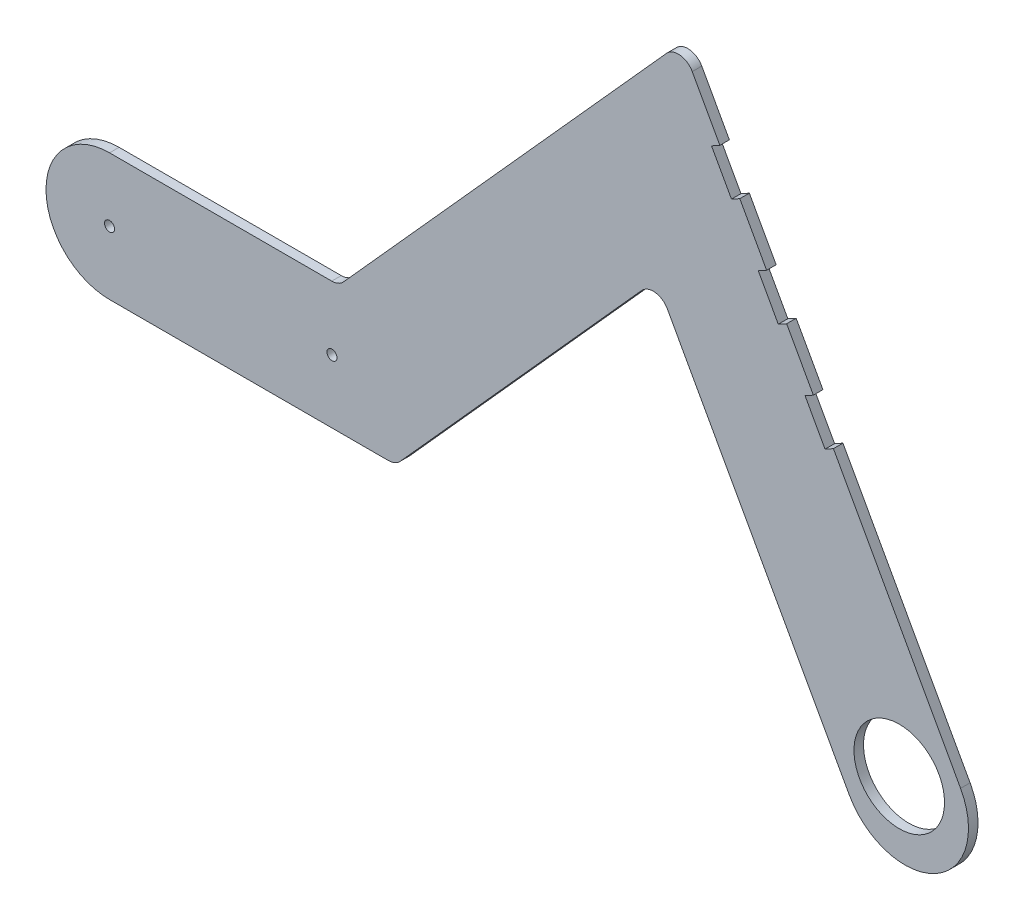
ISO-10303-21;
HEADER;
FILE_DESCRIPTION(('STEP AP214'),'2;1');
FILE_NAME('part.step','',(''),(''),'','','');
FILE_SCHEMA(('AUTOMOTIVE_DESIGN { 1 0 10303 214 1 1 1 1 }'));
ENDSEC;
DATA;
#1=APPLICATION_CONTEXT('core data for automotive mechanical design processes');
#2=APPLICATION_PROTOCOL_DEFINITION('international standard','automotive_design',2000,#1);
#3=PRODUCT_CONTEXT('',#1,'mechanical');
#4=PRODUCT('Part','Part','',(#3));
#5=PRODUCT_RELATED_PRODUCT_CATEGORY('part','',(#4));
#6=PRODUCT_DEFINITION_FORMATION('','',#4);
#7=PRODUCT_DEFINITION_CONTEXT('part definition',#1,'design');
#8=PRODUCT_DEFINITION('design','',#6,#7);
#9=PRODUCT_DEFINITION_SHAPE('','',#8);
#10=(LENGTH_UNIT() NAMED_UNIT(*) SI_UNIT(.MILLI.,.METRE.));
#11=(NAMED_UNIT(*) PLANE_ANGLE_UNIT() SI_UNIT($,.RADIAN.));
#12=(NAMED_UNIT(*) SI_UNIT($,.STERADIAN.) SOLID_ANGLE_UNIT());
#13=UNCERTAINTY_MEASURE_WITH_UNIT(LENGTH_MEASURE(1.E-05),#10,'distance_accuracy_value','');
#14=(GEOMETRIC_REPRESENTATION_CONTEXT(3) GLOBAL_UNCERTAINTY_ASSIGNED_CONTEXT((#13)) GLOBAL_UNIT_ASSIGNED_CONTEXT((#10,
#11,#12)) REPRESENTATION_CONTEXT('',''));
#15=CARTESIAN_POINT('',(0.,0.,0.));
#16=DIRECTION('',(0.,0.,1.));
#17=DIRECTION('',(1.,0.,0.));
#18=AXIS2_PLACEMENT_3D('',#15,#16,#17);
#19=CARTESIAN_POINT('',(47.5853332188057,145.502393907556,3.));
#20=DIRECTION('',(-0.875653678217041,-0.482939577820007,0.));
#21=DIRECTION('',(0.482939577820007,-0.875653678217041,0.));
#22=AXIS2_PLACEMENT_3D('',#19,#20,#21);
#23=PLANE('',#22);
#24=DIRECTION('',(-0.482939577820007,0.875653678217041,0.));
#25=VECTOR('',#24,1.);
#26=CARTESIAN_POINT('',(47.5853332188057,145.502393907556,3.));
#27=LINE('',#26,#25);
#28=CARTESIAN_POINT('',(56.2782456195659,129.740627699649,3.));
#29=VERTEX_POINT('',#28);
#30=CARTESIAN_POINT('',(47.5853332188057,145.502393907556,3.));
#31=VERTEX_POINT('',#30);
#32=EDGE_CURVE('E320',#29,#31,#27,.T.);
#33=ORIENTED_EDGE('',*,*,#32,.F.);
#34=DIRECTION('',(0.,0.,1.));
#35=VECTOR('',#34,1.);
#36=CARTESIAN_POINT('',(56.2782456195659,129.740627699649,3.));
#37=LINE('',#36,#35);
#38=CARTESIAN_POINT('',(56.2782456195659,129.740627699649,0.));
#39=VERTEX_POINT('',#38);
#40=EDGE_CURVE('E221',#39,#29,#37,.T.);
#41=ORIENTED_EDGE('',*,*,#40,.F.);
#42=DIRECTION('',(-0.482939577820007,0.875653678217041,0.));
#43=VECTOR('',#42,1.);
#44=CARTESIAN_POINT('',(47.5853332188057,145.502393907556,0.));
#45=LINE('',#44,#43);
#46=CARTESIAN_POINT('',(47.5853332188057,145.502393907556,0.));
#47=VERTEX_POINT('',#46);
#48=EDGE_CURVE('E348',#39,#47,#45,.T.);
#49=ORIENTED_EDGE('',*,*,#48,.T.);
#50=DIRECTION('',(0.,0.,-1.));
#51=VECTOR('',#50,1.);
#52=CARTESIAN_POINT('',(47.5853332188057,145.502393907556,3.));
#53=LINE('',#52,#51);
#54=EDGE_CURVE('E371',#31,#47,#53,.T.);
#55=ORIENTED_EDGE('',*,*,#54,.F.);
#56=EDGE_LOOP('',(#33,#41,#49,#55));
#57=FACE_BOUND('',#56,.T.);
#58=ADVANCED_FACE('F45',(#57),#23,.F.);
#59=CARTESIAN_POINT('',(70.9962652568578,103.054291306096,0.));
#60=VERTEX_POINT('',#59);
#61=CARTESIAN_POINT('',(62.5576471519857,118.354977607176,0.));
#62=VERTEX_POINT('',#61);
#63=EDGE_CURVE('E443',#60,#62,#45,.T.);
#64=ORIENTED_EDGE('',*,*,#63,.T.);
#65=DIRECTION('',(0.,0.,-1.));
#66=VECTOR('',#65,1.);
#67=CARTESIAN_POINT('',(62.5576471519857,118.354977607176,3.));
#68=LINE('',#67,#66);
#69=CARTESIAN_POINT('',(62.5576471519857,118.354977607176,3.));
#70=VERTEX_POINT('',#69);
#71=EDGE_CURVE('E250',#70,#62,#68,.T.);
#72=ORIENTED_EDGE('',*,*,#71,.F.);
#73=CARTESIAN_POINT('',(70.9962652568578,103.054291306096,3.));
#74=VERTEX_POINT('',#73);
#75=EDGE_CURVE('E228',#74,#70,#27,.T.);
#76=ORIENTED_EDGE('',*,*,#75,.F.);
#77=DIRECTION('',(0.,0.,1.));
#78=VECTOR('',#77,1.);
#79=CARTESIAN_POINT('',(70.9962652568578,103.054291306096,3.));
#80=LINE('',#79,#78);
#81=EDGE_CURVE('E245',#60,#74,#80,.T.);
#82=ORIENTED_EDGE('',*,*,#81,.F.);
#83=EDGE_LOOP('',(#64,#72,#76,#82));
#84=FACE_BOUND('',#83,.T.);
#85=ADVANCED_FACE('F481',(#84),#23,.F.);
#86=CARTESIAN_POINT('',(85.7142848941497,76.3679549125424,0.));
#87=VERTEX_POINT('',#86);
#88=CARTESIAN_POINT('',(77.2977547409545,91.628591905141,0.));
#89=VERTEX_POINT('',#88);
#90=EDGE_CURVE('E353',#87,#89,#45,.T.);
#91=ORIENTED_EDGE('',*,*,#90,.T.);
#92=DIRECTION('',(0.,0.,-1.));
#93=VECTOR('',#92,1.);
#94=CARTESIAN_POINT('',(77.2977547409545,91.628591905141,3.));
#95=LINE('',#94,#93);
#96=CARTESIAN_POINT('',(77.2977547409545,91.628591905141,3.));
#97=VERTEX_POINT('',#96);
#98=EDGE_CURVE('E247',#97,#89,#95,.T.);
#99=ORIENTED_EDGE('',*,*,#98,.F.);
#100=CARTESIAN_POINT('',(85.7142848941497,76.3679549125424,3.));
#101=VERTEX_POINT('',#100);
#102=EDGE_CURVE('E325',#101,#97,#27,.T.);
#103=ORIENTED_EDGE('',*,*,#102,.F.);
#104=DIRECTION('',(0.,0.,1.));
#105=VECTOR('',#104,1.);
#106=CARTESIAN_POINT('',(85.7142848941497,76.3679549125424,3.));
#107=LINE('',#106,#105);
#108=EDGE_CURVE('E271',#87,#101,#107,.T.);
#109=ORIENTED_EDGE('',*,*,#108,.F.);
#110=EDGE_LOOP('',(#91,#99,#103,#109));
#111=FACE_BOUND('',#110,.T.);
#112=ADVANCED_FACE('F452',(#111),#23,.F.);
#113=CARTESIAN_POINT('',(-135.81117841602,11.660861845859,3.));
#114=DIRECTION('',(0.,0.,-1.));
#115=DIRECTION('',(-1.,0.,0.));
#116=AXIS2_PLACEMENT_3D('',#113,#114,#115);
#117=PLANE('',#116);
#118=DIRECTION('',(0.482939577820008,-0.875653678217041,0.));
#119=VECTOR('',#118,1.);
#120=CARTESIAN_POINT('',(53.6512845849147,128.291808966189,3.));
#121=LINE('',#120,#119);
#122=CARTESIAN_POINT('',(53.6512845849147,128.291808966189,3.));
#123=VERTEX_POINT('',#122);
#124=CARTESIAN_POINT('',(59.9306861173346,116.906158873716,3.));
#125=VERTEX_POINT('',#124);
#126=EDGE_CURVE('E212',#123,#125,#121,.T.);
#127=ORIENTED_EDGE('',*,*,#126,.F.);
#128=DIRECTION('',(0.875653678217041,0.482939577820007,0.));
#129=VECTOR('',#128,1.);
#130=CARTESIAN_POINT('',(53.6512845849147,128.291808966189,3.));
#131=LINE('',#130,#129);
#132=EDGE_CURVE('E291',#123,#29,#131,.T.);
#133=ORIENTED_EDGE('',*,*,#132,.T.);
#134=ORIENTED_EDGE('',*,*,#32,.T.);
#135=CARTESIAN_POINT('',(43.2070648277205,143.087696018456,3.));
#136=DIRECTION('',(0.,0.,1.));
#137=DIRECTION('',(1.,0.,0.));
#138=AXIS2_PLACEMENT_3D('',#135,#136,#137);
#139=CIRCLE('',#138,5.);
#140=CARTESIAN_POINT('',(39.4880208236448,146.429658270748,3.));
#141=VERTEX_POINT('',#140);
#142=EDGE_CURVE('E324',#31,#141,#139,.T.);
#143=ORIENTED_EDGE('',*,*,#142,.T.);
#144=DIRECTION('',(-0.668392450458517,-0.743808800815141,0.));
#145=VECTOR('',#144,1.);
#146=CARTESIAN_POINT('',(-62.1541983630746,33.3188995935664,3.));
#147=LINE('',#146,#145);
#148=CARTESIAN_POINT('',(-62.1541983630746,33.3188995935664,3.));
#149=VERTEX_POINT('',#148);
#150=EDGE_CURVE('E327',#141,#149,#147,.T.);
#151=ORIENTED_EDGE('',*,*,#150,.T.);
#152=CARTESIAN_POINT('',(-65.8732423671503,36.660861845859,3.));
#153=DIRECTION('',(0.,0.,-1.));
#154=DIRECTION('',(-1.,0.,0.));
#155=AXIS2_PLACEMENT_3D('',#152,#153,#154);
#156=CIRCLE('',#155,5.);
#157=CARTESIAN_POINT('',(-65.8732423671503,31.660861845859,3.));
#158=VERTEX_POINT('',#157);
#159=EDGE_CURVE('E329',#149,#158,#156,.T.);
#160=ORIENTED_EDGE('',*,*,#159,.T.);
#161=DIRECTION('',(-1.,0.,0.));
#162=VECTOR('',#161,1.);
#163=CARTESIAN_POINT('',(-135.81117841602,31.660861845859,3.));
#164=LINE('',#163,#162);
#165=CARTESIAN_POINT('',(-135.81117841602,31.660861845859,3.));
#166=VERTEX_POINT('',#165);
#167=EDGE_CURVE('E331',#158,#166,#164,.T.);
#168=ORIENTED_EDGE('',*,*,#167,.T.);
#169=CARTESIAN_POINT('',(-135.81117841602,11.660861845859,3.));
#170=DIRECTION('',(0.,0.,1.));
#171=DIRECTION('',(-1.,0.,0.));
#172=AXIS2_PLACEMENT_3D('',#169,#170,#171);
#173=CIRCLE('',#172,20.);
#174=CARTESIAN_POINT('',(-135.81117841602,-8.33913815414105,3.));
#175=VERTEX_POINT('',#174);
#176=EDGE_CURVE('E304',#166,#175,#173,.T.);
#177=ORIENTED_EDGE('',*,*,#176,.T.);
#178=DIRECTION('',(1.,0.,0.));
#179=VECTOR('',#178,1.);
#180=CARTESIAN_POINT('',(-48.0402966328124,-8.33913815414104,3.));
#181=LINE('',#180,#179);
#182=CARTESIAN_POINT('',(-48.0402966328124,-8.33913815414104,3.));
#183=VERTEX_POINT('',#182);
#184=EDGE_CURVE('E307',#175,#183,#181,.T.);
#185=ORIENTED_EDGE('',*,*,#184,.T.);
#186=CARTESIAN_POINT('',(-48.0402966328124,-3.33913815414104,3.));
#187=DIRECTION('',(0.,0.,1.));
#188=DIRECTION('',(-1.,0.,0.));
#189=AXIS2_PLACEMENT_3D('',#186,#187,#188);
#190=CIRCLE('',#189,5.);
#191=CARTESIAN_POINT('',(-44.3212526287367,-6.68110040643362,3.));
#192=VERTEX_POINT('',#191);
#193=EDGE_CURVE('E310',#183,#192,#190,.T.);
#194=ORIENTED_EDGE('',*,*,#193,.T.);
#195=DIRECTION('',(0.668392450458517,0.743808800815141,0.));
#196=VECTOR('',#195,1.);
#197=CARTESIAN_POINT('',(31.6339667735705,77.8443316515208,3.));
#198=LINE('',#197,#196);
#199=CARTESIAN_POINT('',(31.6339667735705,77.8443316515208,3.));
#200=VERTEX_POINT('',#199);
#201=EDGE_CURVE('E312',#192,#200,#198,.T.);
#202=ORIENTED_EDGE('',*,*,#201,.T.);
#203=CARTESIAN_POINT('',(35.3530107776462,74.5023693992282,3.));
#204=DIRECTION('',(0.,0.,-1.));
#205=DIRECTION('',(1.,0.,0.));
#206=AXIS2_PLACEMENT_3D('',#203,#204,#205);
#207=CIRCLE('',#206,5.);
#208=CARTESIAN_POINT('',(39.7312791687314,76.9170672883282,3.));
#209=VERTEX_POINT('',#208);
#210=EDGE_CURVE('E314',#200,#209,#207,.T.);
#211=ORIENTED_EDGE('',*,*,#210,.T.);
#212=DIRECTION('',(0.482939577820007,-0.875653678217041,0.));
#213=VECTOR('',#212,1.);
#214=CARTESIAN_POINT('',(97.0169564632389,-26.9518561462004,3.));
#215=LINE('',#214,#213);
#216=CARTESIAN_POINT('',(97.0169564632389,-26.9518561462004,3.));
#217=VERTEX_POINT('',#216);
#218=EDGE_CURVE('E316',#209,#217,#215,.T.);
#219=ORIENTED_EDGE('',*,*,#218,.T.);
#220=CARTESIAN_POINT('',(114.53003002758,-17.2930645898003,3.));
#221=DIRECTION('',(0.,0.,1.));
#222=DIRECTION('',(-1.,0.,0.));
#223=AXIS2_PLACEMENT_3D('',#220,#221,#222);
#224=CIRCLE('',#223,20.);
#225=CARTESIAN_POINT('',(132.04310359192,-7.63427303340007,3.));
#226=VERTEX_POINT('',#225);
#227=EDGE_CURVE('E318',#217,#226,#224,.T.);
#228=ORIENTED_EDGE('',*,*,#227,.T.);
#229=CARTESIAN_POINT('',(92.0157743782464,64.9422555115878,3.));
#230=VERTEX_POINT('',#229);
#231=EDGE_CURVE('E321',#226,#230,#27,.T.);
#232=ORIENTED_EDGE('',*,*,#231,.T.);
#233=DIRECTION('',(0.875653678217041,0.482939577820007,0.));
#234=VECTOR('',#233,1.);
#235=CARTESIAN_POINT('',(89.3888133435953,63.4934367781278,3.));
#236=LINE('',#235,#234);
#237=CARTESIAN_POINT('',(89.3888133435953,63.4934367781278,3.));
#238=VERTEX_POINT('',#237);
#239=EDGE_CURVE('E260',#238,#230,#236,.T.);
#240=ORIENTED_EDGE('',*,*,#239,.F.);
#241=DIRECTION('',(0.482939577820007,-0.875653678217041,0.));
#242=VECTOR('',#241,1.);
#243=CARTESIAN_POINT('',(83.0873238594985,74.9191361790824,3.));
#244=LINE('',#243,#242);
#245=CARTESIAN_POINT('',(83.0873238594985,74.9191361790824,3.));
#246=VERTEX_POINT('',#245);
#247=EDGE_CURVE('E273',#246,#238,#244,.T.);
#248=ORIENTED_EDGE('',*,*,#247,.F.);
#249=DIRECTION('',(0.875653678217041,0.482939577820007,0.));
#250=VECTOR('',#249,1.);
#251=CARTESIAN_POINT('',(83.0873238594985,74.9191361790824,3.));
#252=LINE('',#251,#250);
#253=EDGE_CURVE('E268',#246,#101,#252,.T.);
#254=ORIENTED_EDGE('',*,*,#253,.T.);
#255=ORIENTED_EDGE('',*,*,#102,.T.);
#256=DIRECTION('',(0.875653678217041,0.482939577820007,0.));
#257=VECTOR('',#256,1.);
#258=CARTESIAN_POINT('',(74.6707937063034,90.179773171681,3.));
#259=LINE('',#258,#257);
#260=CARTESIAN_POINT('',(74.6707937063034,90.179773171681,3.));
#261=VERTEX_POINT('',#260);
#262=EDGE_CURVE('E68',#261,#97,#259,.T.);
#263=ORIENTED_EDGE('',*,*,#262,.F.);
#264=DIRECTION('',(0.482939577820007,-0.875653678217041,0.));
#265=VECTOR('',#264,1.);
#266=CARTESIAN_POINT('',(68.3693042222067,101.605472572636,3.));
#267=LINE('',#266,#265);
#268=CARTESIAN_POINT('',(68.3693042222067,101.605472572636,3.));
#269=VERTEX_POINT('',#268);
#270=EDGE_CURVE('E248',#269,#261,#267,.T.);
#271=ORIENTED_EDGE('',*,*,#270,.F.);
#272=DIRECTION('',(0.875653678217041,0.482939577820007,0.));
#273=VECTOR('',#272,1.);
#274=CARTESIAN_POINT('',(68.3693042222067,101.605472572636,3.));
#275=LINE('',#274,#273);
#276=EDGE_CURVE('E242',#269,#74,#275,.T.);
#277=ORIENTED_EDGE('',*,*,#276,.T.);
#278=ORIENTED_EDGE('',*,*,#75,.T.);
#279=DIRECTION('',(0.875653678217041,0.482939577820007,0.));
#280=VECTOR('',#279,1.);
#281=CARTESIAN_POINT('',(59.9306861173346,116.906158873716,3.));
#282=LINE('',#281,#280);
#283=EDGE_CURVE('E60',#125,#70,#282,.T.);
#284=ORIENTED_EDGE('',*,*,#283,.F.);
#285=EDGE_LOOP('',(#127,#133,#134,#143,#151,#160,#168,#177,#185,#194,#202,#211,#219,#228,#232,
#240,#248,#254,#255,#263,#271,#277,#278,#284));
#286=FACE_BOUND('',#285,.T.);
#287=CARTESIAN_POINT('',(-135.81117841602,11.660861845859,3.));
#288=DIRECTION('',(0.,0.,1.));
#289=DIRECTION('',(1.,0.,0.));
#290=AXIS2_PLACEMENT_3D('',#287,#288,#289);
#291=CIRCLE('',#290,1.58);
#292=CARTESIAN_POINT('',(-134.23117841602,11.660861845859,3.));
#293=VERTEX_POINT('',#292);
#294=EDGE_CURVE('E298',#293,#293,#291,.T.);
#295=ORIENTED_EDGE('',*,*,#294,.F.);
#296=EDGE_LOOP('',(#295));
#297=FACE_BOUND('',#296,.T.);
#298=CARTESIAN_POINT('',(-65.8112157802054,11.5885363003127,3.));
#299=DIRECTION('',(0.,0.,1.));
#300=DIRECTION('',(1.,0.,0.));
#301=AXIS2_PLACEMENT_3D('',#298,#299,#300);
#302=CIRCLE('',#301,1.58);
#303=CARTESIAN_POINT('',(-64.2312157802054,11.5885363003127,3.));
#304=VERTEX_POINT('',#303);
#305=EDGE_CURVE('E292',#304,#304,#302,.T.);
#306=ORIENTED_EDGE('',*,*,#305,.F.);
#307=EDGE_LOOP('',(#306));
#308=FACE_BOUND('',#307,.T.);
#309=CARTESIAN_POINT('',(112.738617641013,-14.0449215144664,3.));
#310=DIRECTION('',(0.,0.,1.));
#311=DIRECTION('',(1.,0.,0.));
#312=AXIS2_PLACEMENT_3D('',#309,#310,#311);
#313=CIRCLE('',#312,14.25);
#314=CARTESIAN_POINT('',(126.988617641013,-14.0449215144664,3.));
#315=VERTEX_POINT('',#314);
#316=EDGE_CURVE('E284',#315,#315,#313,.T.);
#317=ORIENTED_EDGE('',*,*,#316,.F.);
#318=EDGE_LOOP('',(#317));
#319=FACE_BOUND('',#318,.T.);
#320=ADVANCED_FACE('F224',(#286,#297,#308,#319),#117,.F.);
#321=CARTESIAN_POINT('',(-135.81117841602,11.660861845859,0.));
#322=DIRECTION('',(0.,0.,-1.));
#323=DIRECTION('',(-1.,0.,0.));
#324=AXIS2_PLACEMENT_3D('',#321,#322,#323);
#325=PLANE('',#324);
#326=DIRECTION('',(0.875653678217041,0.482939577820007,0.));
#327=VECTOR('',#326,1.);
#328=CARTESIAN_POINT('',(53.6512845849147,128.291808966189,0.));
#329=LINE('',#328,#327);
#330=CARTESIAN_POINT('',(53.6512845849147,128.291808966189,0.));
#331=VERTEX_POINT('',#330);
#332=EDGE_CURVE('E230',#331,#39,#329,.T.);
#333=ORIENTED_EDGE('',*,*,#332,.F.);
#334=DIRECTION('',(-0.482939577820008,0.875653678217041,0.));
#335=VECTOR('',#334,1.);
#336=CARTESIAN_POINT('',(53.6512845849147,128.291808966189,0.));
#337=LINE('',#336,#335);
#338=CARTESIAN_POINT('',(59.9306861173346,116.906158873716,0.));
#339=VERTEX_POINT('',#338);
#340=EDGE_CURVE('E211',#339,#331,#337,.T.);
#341=ORIENTED_EDGE('',*,*,#340,.F.);
#342=DIRECTION('',(0.875653678217041,0.482939577820007,0.));
#343=VECTOR('',#342,1.);
#344=CARTESIAN_POINT('',(59.9306861173346,116.906158873716,0.));
#345=LINE('',#344,#343);
#346=EDGE_CURVE('E208',#339,#62,#345,.T.);
#347=ORIENTED_EDGE('',*,*,#346,.T.);
#348=ORIENTED_EDGE('',*,*,#63,.F.);
#349=DIRECTION('',(0.875653678217041,0.482939577820007,0.));
#350=VECTOR('',#349,1.);
#351=CARTESIAN_POINT('',(68.3693042222067,101.605472572636,0.));
#352=LINE('',#351,#350);
#353=CARTESIAN_POINT('',(68.3693042222067,101.605472572636,0.));
#354=VERTEX_POINT('',#353);
#355=EDGE_CURVE('E240',#354,#60,#352,.T.);
#356=ORIENTED_EDGE('',*,*,#355,.F.);
#357=DIRECTION('',(-0.482939577820007,0.875653678217041,0.));
#358=VECTOR('',#357,1.);
#359=CARTESIAN_POINT('',(68.3693042222067,101.605472572636,0.));
#360=LINE('',#359,#358);
#361=CARTESIAN_POINT('',(74.6707937063034,90.179773171681,0.));
#362=VERTEX_POINT('',#361);
#363=EDGE_CURVE('E253',#362,#354,#360,.T.);
#364=ORIENTED_EDGE('',*,*,#363,.F.);
#365=DIRECTION('',(0.875653678217041,0.482939577820007,0.));
#366=VECTOR('',#365,1.);
#367=CARTESIAN_POINT('',(74.6707937063034,90.179773171681,0.));
#368=LINE('',#367,#366);
#369=EDGE_CURVE('E237',#362,#89,#368,.T.);
#370=ORIENTED_EDGE('',*,*,#369,.T.);
#371=ORIENTED_EDGE('',*,*,#90,.F.);
#372=DIRECTION('',(0.875653678217041,0.482939577820007,0.));
#373=VECTOR('',#372,1.);
#374=CARTESIAN_POINT('',(83.0873238594985,74.9191361790824,0.));
#375=LINE('',#374,#373);
#376=CARTESIAN_POINT('',(83.0873238594985,74.9191361790824,0.));
#377=VERTEX_POINT('',#376);
#378=EDGE_CURVE('E266',#377,#87,#375,.T.);
#379=ORIENTED_EDGE('',*,*,#378,.F.);
#380=DIRECTION('',(-0.482939577820007,0.875653678217041,0.));
#381=VECTOR('',#380,1.);
#382=CARTESIAN_POINT('',(83.0873238594985,74.9191361790824,0.));
#383=LINE('',#382,#381);
#384=CARTESIAN_POINT('',(89.3888133435953,63.4934367781278,0.));
#385=VERTEX_POINT('',#384);
#386=EDGE_CURVE('E277',#385,#377,#383,.T.);
#387=ORIENTED_EDGE('',*,*,#386,.F.);
#388=DIRECTION('',(0.875653678217041,0.482939577820007,0.));
#389=VECTOR('',#388,1.);
#390=CARTESIAN_POINT('',(89.3888133435953,63.4934367781278,0.));
#391=LINE('',#390,#389);
#392=CARTESIAN_POINT('',(92.0157743782464,64.9422555115878,0.));
#393=VERTEX_POINT('',#392);
#394=EDGE_CURVE('E263',#385,#393,#391,.T.);
#395=ORIENTED_EDGE('',*,*,#394,.T.);
#396=CARTESIAN_POINT('',(132.04310359192,-7.63427303340007,0.));
#397=VERTEX_POINT('',#396);
#398=EDGE_CURVE('E349',#397,#393,#45,.T.);
#399=ORIENTED_EDGE('',*,*,#398,.F.);
#400=CARTESIAN_POINT('',(114.53003002758,-17.2930645898003,0.));
#401=DIRECTION('',(0.,0.,1.));
#402=DIRECTION('',(-1.,0.,0.));
#403=AXIS2_PLACEMENT_3D('',#400,#401,#402);
#404=CIRCLE('',#403,20.);
#405=CARTESIAN_POINT('',(97.0169564632389,-26.9518561462004,0.));
#406=VERTEX_POINT('',#405);
#407=EDGE_CURVE('E346',#406,#397,#404,.T.);
#408=ORIENTED_EDGE('',*,*,#407,.F.);
#409=DIRECTION('',(0.482939577820007,-0.875653678217041,0.));
#410=VECTOR('',#409,1.);
#411=CARTESIAN_POINT('',(97.0169564632389,-26.9518561462004,0.));
#412=LINE('',#411,#410);
#413=CARTESIAN_POINT('',(39.7312791687314,76.9170672883282,0.));
#414=VERTEX_POINT('',#413);
#415=EDGE_CURVE('E344',#414,#406,#412,.T.);
#416=ORIENTED_EDGE('',*,*,#415,.F.);
#417=CARTESIAN_POINT('',(35.3530107776462,74.5023693992282,0.));
#418=DIRECTION('',(0.,0.,-1.));
#419=DIRECTION('',(1.,0.,0.));
#420=AXIS2_PLACEMENT_3D('',#417,#418,#419);
#421=CIRCLE('',#420,5.);
#422=CARTESIAN_POINT('',(31.6339667735705,77.8443316515208,0.));
#423=VERTEX_POINT('',#422);
#424=EDGE_CURVE('E342',#423,#414,#421,.T.);
#425=ORIENTED_EDGE('',*,*,#424,.F.);
#426=DIRECTION('',(0.668392450458517,0.743808800815141,0.));
#427=VECTOR('',#426,1.);
#428=CARTESIAN_POINT('',(31.6339667735705,77.8443316515208,0.));
#429=LINE('',#428,#427);
#430=CARTESIAN_POINT('',(-44.3212526287367,-6.68110040643362,0.));
#431=VERTEX_POINT('',#430);
#432=EDGE_CURVE('E340',#431,#423,#429,.T.);
#433=ORIENTED_EDGE('',*,*,#432,.F.);
#434=CARTESIAN_POINT('',(-48.0402966328124,-3.33913815414104,0.));
#435=DIRECTION('',(0.,0.,1.));
#436=DIRECTION('',(-1.,0.,0.));
#437=AXIS2_PLACEMENT_3D('',#434,#435,#436);
#438=CIRCLE('',#437,5.);
#439=CARTESIAN_POINT('',(-48.0402966328124,-8.33913815414104,0.));
#440=VERTEX_POINT('',#439);
#441=EDGE_CURVE('E338',#440,#431,#438,.T.);
#442=ORIENTED_EDGE('',*,*,#441,.F.);
#443=DIRECTION('',(1.,0.,0.));
#444=VECTOR('',#443,1.);
#445=CARTESIAN_POINT('',(-48.0402966328124,-8.33913815414104,0.));
#446=LINE('',#445,#444);
#447=CARTESIAN_POINT('',(-135.81117841602,-8.33913815414105,0.));
#448=VERTEX_POINT('',#447);
#449=EDGE_CURVE('E336',#448,#440,#446,.T.);
#450=ORIENTED_EDGE('',*,*,#449,.F.);
#451=CARTESIAN_POINT('',(-135.81117841602,11.660861845859,0.));
#452=DIRECTION('',(0.,0.,1.));
#453=DIRECTION('',(-1.,0.,0.));
#454=AXIS2_PLACEMENT_3D('',#451,#452,#453);
#455=CIRCLE('',#454,20.);
#456=CARTESIAN_POINT('',(-135.81117841602,31.660861845859,0.));
#457=VERTEX_POINT('',#456);
#458=EDGE_CURVE('E301',#457,#448,#455,.T.);
#459=ORIENTED_EDGE('',*,*,#458,.F.);
#460=DIRECTION('',(-1.,0.,0.));
#461=VECTOR('',#460,1.);
#462=CARTESIAN_POINT('',(-135.81117841602,31.660861845859,0.));
#463=LINE('',#462,#461);
#464=CARTESIAN_POINT('',(-65.8732423671503,31.660861845859,0.));
#465=VERTEX_POINT('',#464);
#466=EDGE_CURVE('E308',#465,#457,#463,.T.);
#467=ORIENTED_EDGE('',*,*,#466,.F.);
#468=CARTESIAN_POINT('',(-65.8732423671503,36.660861845859,0.));
#469=DIRECTION('',(0.,0.,-1.));
#470=DIRECTION('',(-1.,0.,0.));
#471=AXIS2_PLACEMENT_3D('',#468,#469,#470);
#472=CIRCLE('',#471,5.);
#473=CARTESIAN_POINT('',(-62.1541983630746,33.3188995935664,0.));
#474=VERTEX_POINT('',#473);
#475=EDGE_CURVE('E357',#474,#465,#472,.T.);
#476=ORIENTED_EDGE('',*,*,#475,.F.);
#477=DIRECTION('',(-0.668392450458517,-0.743808800815141,0.));
#478=VECTOR('',#477,1.);
#479=CARTESIAN_POINT('',(-62.1541983630746,33.3188995935664,0.));
#480=LINE('',#479,#478);
#481=CARTESIAN_POINT('',(39.4880208236448,146.429658270748,0.));
#482=VERTEX_POINT('',#481);
#483=EDGE_CURVE('E355',#482,#474,#480,.T.);
#484=ORIENTED_EDGE('',*,*,#483,.F.);
#485=CARTESIAN_POINT('',(43.2070648277205,143.087696018456,0.));
#486=DIRECTION('',(0.,0.,1.));
#487=DIRECTION('',(1.,0.,0.));
#488=AXIS2_PLACEMENT_3D('',#485,#486,#487);
#489=CIRCLE('',#488,5.);
#490=EDGE_CURVE('E352',#47,#482,#489,.T.);
#491=ORIENTED_EDGE('',*,*,#490,.F.);
#492=ORIENTED_EDGE('',*,*,#48,.F.);
#493=EDGE_LOOP('',(#333,#341,#347,#348,#356,#364,#370,#371,#379,#387,#395,#399,#408,#416,#425,
#433,#442,#450,#459,#467,#476,#484,#491,#492));
#494=FACE_BOUND('',#493,.T.);
#495=CARTESIAN_POINT('',(-65.8112157802054,11.5885363003127,0.));
#496=DIRECTION('',(0.,0.,1.));
#497=DIRECTION('',(1.,0.,0.));
#498=AXIS2_PLACEMENT_3D('',#495,#496,#497);
#499=CIRCLE('',#498,1.58);
#500=CARTESIAN_POINT('',(-64.2312157802054,11.5885363003127,0.));
#501=VERTEX_POINT('',#500);
#502=EDGE_CURVE('E287',#501,#501,#499,.T.);
#503=ORIENTED_EDGE('',*,*,#502,.T.);
#504=EDGE_LOOP('',(#503));
#505=FACE_BOUND('',#504,.T.);
#506=CARTESIAN_POINT('',(-135.81117841602,11.660861845859,0.));
#507=DIRECTION('',(0.,0.,1.));
#508=DIRECTION('',(1.,0.,0.));
#509=AXIS2_PLACEMENT_3D('',#506,#507,#508);
#510=CIRCLE('',#509,1.58);
#511=CARTESIAN_POINT('',(-134.23117841602,11.660861845859,0.));
#512=VERTEX_POINT('',#511);
#513=EDGE_CURVE('E295',#512,#512,#510,.T.);
#514=ORIENTED_EDGE('',*,*,#513,.T.);
#515=EDGE_LOOP('',(#514));
#516=FACE_BOUND('',#515,.T.);
#517=CARTESIAN_POINT('',(112.738617641013,-14.0449215144664,0.));
#518=DIRECTION('',(0.,0.,1.));
#519=DIRECTION('',(1.,0.,0.));
#520=AXIS2_PLACEMENT_3D('',#517,#518,#519);
#521=CIRCLE('',#520,14.25);
#522=CARTESIAN_POINT('',(126.988617641013,-14.0449215144664,0.));
#523=VERTEX_POINT('',#522);
#524=EDGE_CURVE('E288',#523,#523,#521,.T.);
#525=ORIENTED_EDGE('',*,*,#524,.T.);
#526=EDGE_LOOP('',(#525));
#527=FACE_BOUND('',#526,.T.);
#528=ADVANCED_FACE('F399',(#494,#505,#516,#527),#325,.T.);
#529=CARTESIAN_POINT('',(-135.81117841602,11.660861845859,3.));
#530=DIRECTION('',(0.,0.,-1.));
#531=DIRECTION('',(-1.,0.,0.));
#532=AXIS2_PLACEMENT_3D('',#529,#530,#531);
#533=CYLINDRICAL_SURFACE('',#532,20.);
#534=ORIENTED_EDGE('',*,*,#458,.T.);
#535=DIRECTION('',(0.,0.,-1.));
#536=VECTOR('',#535,1.);
#537=CARTESIAN_POINT('',(-135.81117841602,-8.33913815414105,3.));
#538=LINE('',#537,#536);
#539=EDGE_CURVE('E11',#175,#448,#538,.T.);
#540=ORIENTED_EDGE('',*,*,#539,.F.);
#541=ORIENTED_EDGE('',*,*,#176,.F.);
#542=DIRECTION('',(0.,0.,-1.));
#543=VECTOR('',#542,1.);
#544=CARTESIAN_POINT('',(-135.81117841602,31.660861845859,3.));
#545=LINE('',#544,#543);
#546=EDGE_CURVE('E333',#166,#457,#545,.T.);
#547=ORIENTED_EDGE('',*,*,#546,.T.);
#548=EDGE_LOOP('',(#534,#540,#541,#547));
#549=FACE_BOUND('',#548,.T.);
#550=ADVANCED_FACE('F47',(#549),#533,.T.);
#551=CARTESIAN_POINT('',(-48.0402966328124,-8.33913815414104,3.));
#552=DIRECTION('',(0.,1.,0.));
#553=DIRECTION('',(-1.,0.,0.));
#554=AXIS2_PLACEMENT_3D('',#551,#552,#553);
#555=PLANE('',#554);
#556=ORIENTED_EDGE('',*,*,#449,.T.);
#557=DIRECTION('',(0.,0.,-1.));
#558=VECTOR('',#557,1.);
#559=CARTESIAN_POINT('',(-48.0402966328124,-8.33913815414104,3.));
#560=LINE('',#559,#558);
#561=EDGE_CURVE('E53',#183,#440,#560,.T.);
#562=ORIENTED_EDGE('',*,*,#561,.F.);
#563=ORIENTED_EDGE('',*,*,#184,.F.);
#564=ORIENTED_EDGE('',*,*,#539,.T.);
#565=EDGE_LOOP('',(#556,#562,#563,#564));
#566=FACE_BOUND('',#565,.T.);
#567=ADVANCED_FACE('F416',(#566),#555,.F.);
#568=CARTESIAN_POINT('',(-48.0402966328124,-3.33913815414104,3.));
#569=DIRECTION('',(0.,0.,-1.));
#570=DIRECTION('',(-1.,0.,0.));
#571=AXIS2_PLACEMENT_3D('',#568,#569,#570);
#572=CYLINDRICAL_SURFACE('',#571,5.);
#573=ORIENTED_EDGE('',*,*,#441,.T.);
#574=DIRECTION('',(0.,0.,-1.));
#575=VECTOR('',#574,1.);
#576=CARTESIAN_POINT('',(-44.3212526287367,-6.68110040643362,3.));
#577=LINE('',#576,#575);
#578=EDGE_CURVE('E386',#192,#431,#577,.T.);
#579=ORIENTED_EDGE('',*,*,#578,.F.);
#580=ORIENTED_EDGE('',*,*,#193,.F.);
#581=ORIENTED_EDGE('',*,*,#561,.T.);
#582=EDGE_LOOP('',(#573,#579,#580,#581));
#583=FACE_BOUND('',#582,.T.);
#584=ADVANCED_FACE('F393',(#583),#572,.T.);
#585=CARTESIAN_POINT('',(31.6339667735705,77.8443316515208,3.));
#586=DIRECTION('',(-0.743808800815141,0.668392450458517,0.));
#587=DIRECTION('',(-0.668392450458517,-0.743808800815141,0.));
#588=AXIS2_PLACEMENT_3D('',#585,#586,#587);
#589=PLANE('',#588);
#590=ORIENTED_EDGE('',*,*,#432,.T.);
#591=DIRECTION('',(0.,0.,-1.));
#592=VECTOR('',#591,1.);
#593=CARTESIAN_POINT('',(31.6339667735705,77.8443316515208,3.));
#594=LINE('',#593,#592);
#595=EDGE_CURVE('E383',#200,#423,#594,.T.);
#596=ORIENTED_EDGE('',*,*,#595,.F.);
#597=ORIENTED_EDGE('',*,*,#201,.F.);
#598=ORIENTED_EDGE('',*,*,#578,.T.);
#599=EDGE_LOOP('',(#590,#596,#597,#598));
#600=FACE_BOUND('',#599,.T.);
#601=ADVANCED_FACE('F406',(#600),#589,.F.);
#602=CARTESIAN_POINT('',(35.3530107776462,74.5023693992282,3.));
#603=DIRECTION('',(0.,0.,-1.));
#604=DIRECTION('',(-1.,0.,0.));
#605=AXIS2_PLACEMENT_3D('',#602,#603,#604);
#606=CYLINDRICAL_SURFACE('',#605,5.);
#607=ORIENTED_EDGE('',*,*,#424,.T.);
#608=DIRECTION('',(0.,0.,-1.));
#609=VECTOR('',#608,1.);
#610=CARTESIAN_POINT('',(39.7312791687314,76.9170672883282,3.));
#611=LINE('',#610,#609);
#612=EDGE_CURVE('E380',#209,#414,#611,.T.);
#613=ORIENTED_EDGE('',*,*,#612,.F.);
#614=ORIENTED_EDGE('',*,*,#210,.F.);
#615=ORIENTED_EDGE('',*,*,#595,.T.);
#616=EDGE_LOOP('',(#607,#613,#614,#615));
#617=FACE_BOUND('',#616,.T.);
#618=ADVANCED_FACE('F410',(#617),#606,.F.);
#619=CARTESIAN_POINT('',(97.0169564632389,-26.9518561462004,3.));
#620=DIRECTION('',(0.875653678217041,0.482939577820007,0.));
#621=DIRECTION('',(-0.482939577820007,0.875653678217041,0.));
#622=AXIS2_PLACEMENT_3D('',#619,#620,#621);
#623=PLANE('',#622);
#624=ORIENTED_EDGE('',*,*,#415,.T.);
#625=DIRECTION('',(0.,0.,-1.));
#626=VECTOR('',#625,1.);
#627=CARTESIAN_POINT('',(97.0169564632389,-26.9518561462004,3.));
#628=LINE('',#627,#626);
#629=EDGE_CURVE('E377',#217,#406,#628,.T.);
#630=ORIENTED_EDGE('',*,*,#629,.F.);
#631=ORIENTED_EDGE('',*,*,#218,.F.);
#632=ORIENTED_EDGE('',*,*,#612,.T.);
#633=EDGE_LOOP('',(#624,#630,#631,#632));
#634=FACE_BOUND('',#633,.T.);
#635=ADVANCED_FACE('F499',(#634),#623,.F.);
#636=CARTESIAN_POINT('',(114.53003002758,-17.2930645898003,3.));
#637=DIRECTION('',(0.,0.,-1.));
#638=DIRECTION('',(-1.,0.,0.));
#639=AXIS2_PLACEMENT_3D('',#636,#637,#638);
#640=CYLINDRICAL_SURFACE('',#639,20.);
#641=ORIENTED_EDGE('',*,*,#407,.T.);
#642=DIRECTION('',(0.,0.,-1.));
#643=VECTOR('',#642,1.);
#644=CARTESIAN_POINT('',(132.04310359192,-7.63427303340007,3.));
#645=LINE('',#644,#643);
#646=EDGE_CURVE('E374',#226,#397,#645,.T.);
#647=ORIENTED_EDGE('',*,*,#646,.F.);
#648=ORIENTED_EDGE('',*,*,#227,.F.);
#649=ORIENTED_EDGE('',*,*,#629,.T.);
#650=EDGE_LOOP('',(#641,#647,#648,#649));
#651=FACE_BOUND('',#650,.T.);
#652=ADVANCED_FACE('F491',(#651),#640,.T.);
#653=ORIENTED_EDGE('',*,*,#398,.T.);
#654=DIRECTION('',(0.,0.,-1.));
#655=VECTOR('',#654,1.);
#656=CARTESIAN_POINT('',(92.0157743782464,64.9422555115878,3.));
#657=LINE('',#656,#655);
#658=EDGE_CURVE('E244',#230,#393,#657,.T.);
#659=ORIENTED_EDGE('',*,*,#658,.F.);
#660=ORIENTED_EDGE('',*,*,#231,.F.);
#661=ORIENTED_EDGE('',*,*,#646,.T.);
#662=EDGE_LOOP('',(#653,#659,#660,#661));
#663=FACE_BOUND('',#662,.T.);
#664=ADVANCED_FACE('F483',(#663),#23,.F.);
#665=CARTESIAN_POINT('',(43.2070648277205,143.087696018456,3.));
#666=DIRECTION('',(0.,0.,-1.));
#667=DIRECTION('',(-1.,0.,0.));
#668=AXIS2_PLACEMENT_3D('',#665,#666,#667);
#669=CYLINDRICAL_SURFACE('',#668,5.);
#670=ORIENTED_EDGE('',*,*,#490,.T.);
#671=DIRECTION('',(0.,0.,-1.));
#672=VECTOR('',#671,1.);
#673=CARTESIAN_POINT('',(39.4880208236448,146.429658270748,3.));
#674=LINE('',#673,#672);
#675=EDGE_CURVE('E368',#141,#482,#674,.T.);
#676=ORIENTED_EDGE('',*,*,#675,.F.);
#677=ORIENTED_EDGE('',*,*,#142,.F.);
#678=ORIENTED_EDGE('',*,*,#54,.T.);
#679=EDGE_LOOP('',(#670,#676,#677,#678));
#680=FACE_BOUND('',#679,.T.);
#681=ADVANCED_FACE('F437',(#680),#669,.T.);
#682=CARTESIAN_POINT('',(-62.1541983630746,33.3188995935664,3.));
#683=DIRECTION('',(0.743808800815141,-0.668392450458517,0.));
#684=DIRECTION('',(0.668392450458517,0.743808800815141,0.));
#685=AXIS2_PLACEMENT_3D('',#682,#683,#684);
#686=PLANE('',#685);
#687=ORIENTED_EDGE('',*,*,#483,.T.);
#688=DIRECTION('',(0.,0.,-1.));
#689=VECTOR('',#688,1.);
#690=CARTESIAN_POINT('',(-62.1541983630746,33.3188995935664,3.));
#691=LINE('',#690,#689);
#692=EDGE_CURVE('E365',#149,#474,#691,.T.);
#693=ORIENTED_EDGE('',*,*,#692,.F.);
#694=ORIENTED_EDGE('',*,*,#150,.F.);
#695=ORIENTED_EDGE('',*,*,#675,.T.);
#696=EDGE_LOOP('',(#687,#693,#694,#695));
#697=FACE_BOUND('',#696,.T.);
#698=ADVANCED_FACE('F432',(#697),#686,.F.);
#699=CARTESIAN_POINT('',(-65.8732423671503,36.660861845859,3.));
#700=DIRECTION('',(0.,0.,-1.));
#701=DIRECTION('',(-1.,0.,0.));
#702=AXIS2_PLACEMENT_3D('',#699,#700,#701);
#703=CYLINDRICAL_SURFACE('',#702,5.);
#704=ORIENTED_EDGE('',*,*,#475,.T.);
#705=DIRECTION('',(0.,0.,-1.));
#706=VECTOR('',#705,1.);
#707=CARTESIAN_POINT('',(-65.8732423671503,31.660861845859,3.));
#708=LINE('',#707,#706);
#709=EDGE_CURVE('E362',#158,#465,#708,.T.);
#710=ORIENTED_EDGE('',*,*,#709,.F.);
#711=ORIENTED_EDGE('',*,*,#159,.F.);
#712=ORIENTED_EDGE('',*,*,#692,.T.);
#713=EDGE_LOOP('',(#704,#710,#711,#712));
#714=FACE_BOUND('',#713,.T.);
#715=ADVANCED_FACE('F428',(#714),#703,.F.);
#716=CARTESIAN_POINT('',(-135.81117841602,31.660861845859,3.));
#717=DIRECTION('',(0.,-1.,0.));
#718=DIRECTION('',(0.,0.,-1.));
#719=AXIS2_PLACEMENT_3D('',#716,#717,#718);
#720=PLANE('',#719);
#721=ORIENTED_EDGE('',*,*,#466,.T.);
#722=ORIENTED_EDGE('',*,*,#546,.F.);
#723=ORIENTED_EDGE('',*,*,#167,.F.);
#724=ORIENTED_EDGE('',*,*,#709,.T.);
#725=EDGE_LOOP('',(#721,#722,#723,#724));
#726=FACE_BOUND('',#725,.T.);
#727=ADVANCED_FACE('F423',(#726),#720,.F.);
#728=CARTESIAN_POINT('',(-135.81117841602,11.660861845859,3.));
#729=DIRECTION('',(0.,0.,-1.));
#730=DIRECTION('',(-1.,0.,0.));
#731=AXIS2_PLACEMENT_3D('',#728,#729,#730);
#732=CYLINDRICAL_SURFACE('',#731,1.58);
#733=ORIENTED_EDGE('',*,*,#294,.T.);
#734=EDGE_LOOP('',(#733));
#735=FACE_BOUND('',#734,.T.);
#736=ORIENTED_EDGE('',*,*,#513,.F.);
#737=EDGE_LOOP('',(#736));
#738=FACE_BOUND('',#737,.T.);
#739=ADVANCED_FACE('F510',(#735,#738),#732,.F.);
#740=CARTESIAN_POINT('',(-65.8112157802054,11.5885363003127,3.));
#741=DIRECTION('',(0.,0.,-1.));
#742=DIRECTION('',(-1.,0.,0.));
#743=AXIS2_PLACEMENT_3D('',#740,#741,#742);
#744=CYLINDRICAL_SURFACE('',#743,1.58);
#745=ORIENTED_EDGE('',*,*,#305,.T.);
#746=EDGE_LOOP('',(#745));
#747=FACE_BOUND('',#746,.T.);
#748=ORIENTED_EDGE('',*,*,#502,.F.);
#749=EDGE_LOOP('',(#748));
#750=FACE_BOUND('',#749,.T.);
#751=ADVANCED_FACE('F539',(#747,#750),#744,.F.);
#752=CARTESIAN_POINT('',(112.738617641013,-14.0449215144664,3.));
#753=DIRECTION('',(0.,0.,-1.));
#754=DIRECTION('',(-1.,0.,0.));
#755=AXIS2_PLACEMENT_3D('',#752,#753,#754);
#756=CYLINDRICAL_SURFACE('',#755,14.25);
#757=ORIENTED_EDGE('',*,*,#316,.T.);
#758=EDGE_LOOP('',(#757));
#759=FACE_BOUND('',#758,.T.);
#760=ORIENTED_EDGE('',*,*,#524,.F.);
#761=EDGE_LOOP('',(#760));
#762=FACE_BOUND('',#761,.T.);
#763=ADVANCED_FACE('F546',(#759,#762),#756,.F.);
#764=CARTESIAN_POINT('',(83.0873238594985,74.9191361790824,3.));
#765=DIRECTION('',(-0.482939577820007,0.875653678217041,0.));
#766=DIRECTION('',(-0.875653678217041,-0.482939577820008,0.));
#767=AXIS2_PLACEMENT_3D('',#764,#765,#766);
#768=PLANE('',#767);
#769=ORIENTED_EDGE('',*,*,#108,.T.);
#770=ORIENTED_EDGE('',*,*,#253,.F.);
#771=DIRECTION('',(0.,0.,1.));
#772=VECTOR('',#771,1.);
#773=CARTESIAN_POINT('',(83.0873238594985,74.9191361790824,3.));
#774=LINE('',#773,#772);
#775=EDGE_CURVE('E262',#377,#246,#774,.T.);
#776=ORIENTED_EDGE('',*,*,#775,.F.);
#777=ORIENTED_EDGE('',*,*,#378,.T.);
#778=EDGE_LOOP('',(#769,#770,#776,#777));
#779=FACE_BOUND('',#778,.T.);
#780=ADVANCED_FACE('F553',(#779),#768,.F.);
#781=CARTESIAN_POINT('',(89.3888133435953,63.4934367781278,3.));
#782=DIRECTION('',(0.482939577820007,-0.875653678217041,0.));
#783=DIRECTION('',(0.875653678217041,0.482939577820008,0.));
#784=AXIS2_PLACEMENT_3D('',#781,#782,#783);
#785=PLANE('',#784);
#786=ORIENTED_EDGE('',*,*,#658,.T.);
#787=ORIENTED_EDGE('',*,*,#394,.F.);
#788=DIRECTION('',(0.,0.,-1.));
#789=VECTOR('',#788,1.);
#790=CARTESIAN_POINT('',(89.3888133435953,63.4934367781278,3.));
#791=LINE('',#790,#789);
#792=EDGE_CURVE('E279',#238,#385,#791,.T.);
#793=ORIENTED_EDGE('',*,*,#792,.F.);
#794=ORIENTED_EDGE('',*,*,#239,.T.);
#795=EDGE_LOOP('',(#786,#787,#793,#794));
#796=FACE_BOUND('',#795,.T.);
#797=ADVANCED_FACE('F579',(#796),#785,.F.);
#798=CARTESIAN_POINT('',(95.3912044875967,52.6100548298769,0.));
#799=DIRECTION('',(0.875653678217041,0.482939577820007,0.));
#800=DIRECTION('',(-0.482939577820007,0.875653678217041,0.));
#801=AXIS2_PLACEMENT_3D('',#798,#799,#800);
#802=PLANE('',#801);
#803=ORIENTED_EDGE('',*,*,#247,.T.);
#804=ORIENTED_EDGE('',*,*,#792,.T.);
#805=ORIENTED_EDGE('',*,*,#386,.T.);
#806=ORIENTED_EDGE('',*,*,#775,.T.);
#807=EDGE_LOOP('',(#803,#804,#805,#806));
#808=FACE_BOUND('',#807,.T.);
#809=ADVANCED_FACE('F589',(#808),#802,.T.);
#810=CARTESIAN_POINT('',(68.3693042222067,101.605472572636,3.));
#811=DIRECTION('',(-0.482939577820007,0.875653678217041,0.));
#812=DIRECTION('',(-0.875653678217041,-0.482939577820008,0.));
#813=AXIS2_PLACEMENT_3D('',#810,#811,#812);
#814=PLANE('',#813);
#815=ORIENTED_EDGE('',*,*,#81,.T.);
#816=ORIENTED_EDGE('',*,*,#276,.F.);
#817=DIRECTION('',(0.,0.,1.));
#818=VECTOR('',#817,1.);
#819=CARTESIAN_POINT('',(68.3693042222067,101.605472572636,3.));
#820=LINE('',#819,#818);
#821=EDGE_CURVE('E236',#354,#269,#820,.T.);
#822=ORIENTED_EDGE('',*,*,#821,.F.);
#823=ORIENTED_EDGE('',*,*,#355,.T.);
#824=EDGE_LOOP('',(#815,#816,#822,#823));
#825=FACE_BOUND('',#824,.T.);
#826=ADVANCED_FACE('F599',(#825),#814,.F.);
#827=CARTESIAN_POINT('',(74.6707937063034,90.179773171681,3.));
#828=DIRECTION('',(0.482939577820007,-0.875653678217041,0.));
#829=DIRECTION('',(0.875653678217041,0.482939577820008,0.));
#830=AXIS2_PLACEMENT_3D('',#827,#828,#829);
#831=PLANE('',#830);
#832=ORIENTED_EDGE('',*,*,#98,.T.);
#833=ORIENTED_EDGE('',*,*,#369,.F.);
#834=DIRECTION('',(0.,0.,-1.));
#835=VECTOR('',#834,1.);
#836=CARTESIAN_POINT('',(74.6707937063034,90.179773171681,3.));
#837=LINE('',#836,#835);
#838=EDGE_CURVE('E255',#261,#362,#837,.T.);
#839=ORIENTED_EDGE('',*,*,#838,.F.);
#840=ORIENTED_EDGE('',*,*,#262,.T.);
#841=EDGE_LOOP('',(#832,#833,#839,#840));
#842=FACE_BOUND('',#841,.T.);
#843=ADVANCED_FACE('F459',(#842),#831,.F.);
#844=CARTESIAN_POINT('',(95.3912044875967,52.6100548298769,0.));
#845=DIRECTION('',(0.875653678217041,0.482939577820007,0.));
#846=DIRECTION('',(-0.482939577820007,0.875653678217041,0.));
#847=AXIS2_PLACEMENT_3D('',#844,#845,#846);
#848=PLANE('',#847);
#849=ORIENTED_EDGE('',*,*,#270,.T.);
#850=ORIENTED_EDGE('',*,*,#838,.T.);
#851=ORIENTED_EDGE('',*,*,#363,.T.);
#852=ORIENTED_EDGE('',*,*,#821,.T.);
#853=EDGE_LOOP('',(#849,#850,#851,#852));
#854=FACE_BOUND('',#853,.T.);
#855=ADVANCED_FACE('F461',(#854),#848,.T.);
#856=CARTESIAN_POINT('',(53.6512845849147,128.291808966189,3.));
#857=DIRECTION('',(-0.482939577820007,0.875653678217041,0.));
#858=DIRECTION('',(-0.875653678217041,-0.482939577820008,0.));
#859=AXIS2_PLACEMENT_3D('',#856,#857,#858);
#860=PLANE('',#859);
#861=ORIENTED_EDGE('',*,*,#40,.T.);
#862=ORIENTED_EDGE('',*,*,#132,.F.);
#863=DIRECTION('',(0.,0.,1.));
#864=VECTOR('',#863,1.);
#865=CARTESIAN_POINT('',(53.6512845849147,128.291808966189,3.));
#866=LINE('',#865,#864);
#867=EDGE_CURVE('E218',#331,#123,#866,.T.);
#868=ORIENTED_EDGE('',*,*,#867,.F.);
#869=ORIENTED_EDGE('',*,*,#332,.T.);
#870=EDGE_LOOP('',(#861,#862,#868,#869));
#871=FACE_BOUND('',#870,.T.);
#872=ADVANCED_FACE('F470',(#871),#860,.F.);
#873=CARTESIAN_POINT('',(59.9306861173346,116.906158873716,3.));
#874=DIRECTION('',(0.482939577820007,-0.875653678217041,0.));
#875=DIRECTION('',(0.875653678217041,0.482939577820008,0.));
#876=AXIS2_PLACEMENT_3D('',#873,#874,#875);
#877=PLANE('',#876);
#878=ORIENTED_EDGE('',*,*,#71,.T.);
#879=ORIENTED_EDGE('',*,*,#346,.F.);
#880=DIRECTION('',(0.,0.,-1.));
#881=VECTOR('',#880,1.);
#882=CARTESIAN_POINT('',(59.9306861173346,116.906158873716,3.));
#883=LINE('',#882,#881);
#884=EDGE_CURVE('E204',#125,#339,#883,.T.);
#885=ORIENTED_EDGE('',*,*,#884,.F.);
#886=ORIENTED_EDGE('',*,*,#283,.T.);
#887=EDGE_LOOP('',(#878,#879,#885,#886));
#888=FACE_BOUND('',#887,.T.);
#889=ADVANCED_FACE('F206',(#888),#877,.F.);
#890=CARTESIAN_POINT('',(95.3912044875967,52.610054829877,0.));
#891=DIRECTION('',(0.875653678217041,0.482939577820008,0.));
#892=DIRECTION('',(-0.482939577820008,0.875653678217041,0.));
#893=AXIS2_PLACEMENT_3D('',#890,#891,#892);
#894=PLANE('',#893);
#895=ORIENTED_EDGE('',*,*,#126,.T.);
#896=ORIENTED_EDGE('',*,*,#884,.T.);
#897=ORIENTED_EDGE('',*,*,#340,.T.);
#898=ORIENTED_EDGE('',*,*,#867,.T.);
#899=EDGE_LOOP('',(#895,#896,#897,#898));
#900=FACE_BOUND('',#899,.T.);
#901=ADVANCED_FACE('F216',(#900),#894,.T.);
#902=CLOSED_SHELL('',(#58,#85,#112,#320,#528,#550,#567,#584,#601,#618,#635,#652,#664,#681,#698,
#715,#727,#739,#751,#763,#780,#797,#809,#826,#843,#855,#872,#889,#901));
#903=MANIFOLD_SOLID_BREP('B2',#902);
#904=ADVANCED_BREP_SHAPE_REPRESENTATION('',(#18,#903),#14);
#905=SHAPE_DEFINITION_REPRESENTATION(#9,#904);
ENDSEC;
END-ISO-10303-21;
